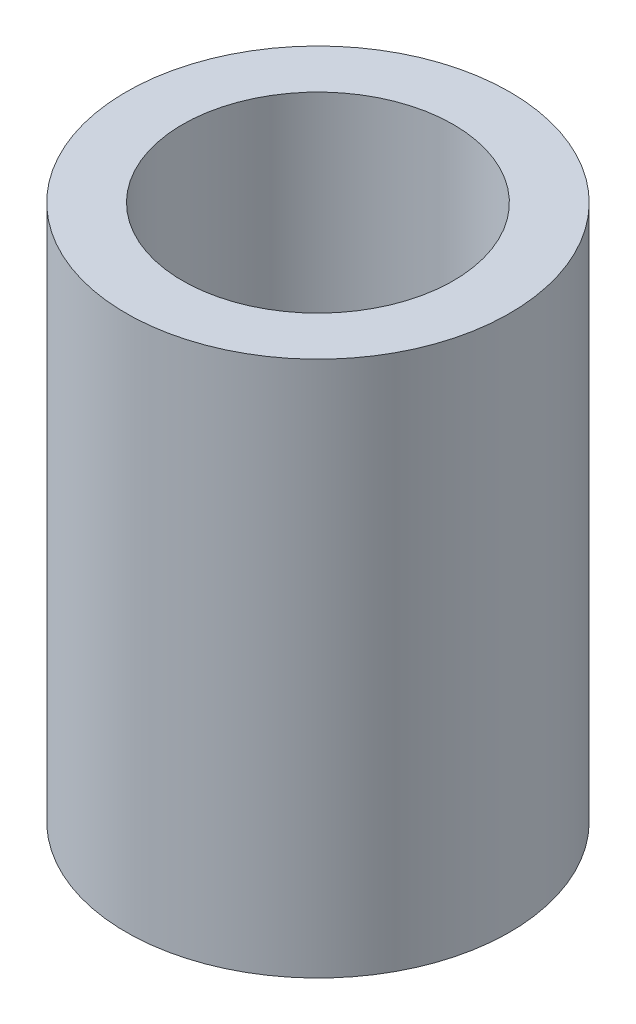
ISO-10303-21;
HEADER;
FILE_DESCRIPTION(('STEP AP214'),'2;1');
FILE_NAME('part.step','',(''),(''),'','','');
FILE_SCHEMA(('AUTOMOTIVE_DESIGN { 1 0 10303 214 1 1 1 1 }'));
ENDSEC;
DATA;
#1=APPLICATION_CONTEXT('core data for automotive mechanical design processes');
#2=APPLICATION_PROTOCOL_DEFINITION('international standard','automotive_design',2000,#1);
#3=PRODUCT_CONTEXT('',#1,'mechanical');
#4=PRODUCT('Part','Part','',(#3));
#5=PRODUCT_RELATED_PRODUCT_CATEGORY('part','',(#4));
#6=PRODUCT_DEFINITION_FORMATION('','',#4);
#7=PRODUCT_DEFINITION_CONTEXT('part definition',#1,'design');
#8=PRODUCT_DEFINITION('design','',#6,#7);
#9=PRODUCT_DEFINITION_SHAPE('','',#8);
#10=(LENGTH_UNIT() NAMED_UNIT(*) SI_UNIT(.MILLI.,.METRE.));
#11=(NAMED_UNIT(*) PLANE_ANGLE_UNIT() SI_UNIT($,.RADIAN.));
#12=(NAMED_UNIT(*) SI_UNIT($,.STERADIAN.) SOLID_ANGLE_UNIT());
#13=UNCERTAINTY_MEASURE_WITH_UNIT(LENGTH_MEASURE(1.E-05),#10,'distance_accuracy_value','');
#14=(GEOMETRIC_REPRESENTATION_CONTEXT(3) GLOBAL_UNCERTAINTY_ASSIGNED_CONTEXT((#13)) GLOBAL_UNIT_ASSIGNED_CONTEXT((#10,
#11,#12)) REPRESENTATION_CONTEXT('',''));
#15=CARTESIAN_POINT('',(0.,0.,0.));
#16=DIRECTION('',(0.,0.,1.));
#17=DIRECTION('',(1.,0.,0.));
#18=AXIS2_PLACEMENT_3D('',#15,#16,#17);
#19=CARTESIAN_POINT('',(0.,0.,0.));
#20=DIRECTION('',(0.,-1.,0.));
#21=DIRECTION('',(0.,0.,-1.));
#22=AXIS2_PLACEMENT_3D('',#19,#20,#21);
#23=CYLINDRICAL_SURFACE('',#22,24.);
#24=CARTESIAN_POINT('',(0.,0.,0.));
#25=DIRECTION('',(0.,-1.,0.));
#26=DIRECTION('',(0.,0.,-1.));
#27=AXIS2_PLACEMENT_3D('',#24,#25,#26);
#28=CIRCLE('',#27,24.);
#29=CARTESIAN_POINT('',(0.,0.,-24.));
#30=VERTEX_POINT('',#29);
#31=EDGE_CURVE('E51',#30,#30,#28,.T.);
#32=ORIENTED_EDGE('',*,*,#31,.T.);
#33=EDGE_LOOP('',(#32));
#34=FACE_BOUND('',#33,.T.);
#35=CARTESIAN_POINT('',(0.,95.,0.));
#36=DIRECTION('',(0.,-1.,0.));
#37=DIRECTION('',(0.,0.,-1.));
#38=AXIS2_PLACEMENT_3D('',#35,#36,#37);
#39=CIRCLE('',#38,24.);
#40=CARTESIAN_POINT('',(0.,95.,-24.));
#41=VERTEX_POINT('',#40);
#42=EDGE_CURVE('E10',#41,#41,#39,.T.);
#43=ORIENTED_EDGE('',*,*,#42,.F.);
#44=EDGE_LOOP('',(#43));
#45=FACE_BOUND('',#44,.T.);
#46=ADVANCED_FACE('F37',(#34,#45),#23,.F.);
#47=CARTESIAN_POINT('',(24.,95.,0.));
#48=DIRECTION('',(0.,1.,0.));
#49=DIRECTION('',(0.,0.,1.));
#50=AXIS2_PLACEMENT_3D('',#47,#48,#49);
#51=PLANE('',#50);
#52=ORIENTED_EDGE('',*,*,#42,.T.);
#53=EDGE_LOOP('',(#52));
#54=FACE_BOUND('',#53,.T.);
#55=CARTESIAN_POINT('',(0.,95.,0.));
#56=DIRECTION('',(0.,-1.,0.));
#57=DIRECTION('',(0.,0.,-1.));
#58=AXIS2_PLACEMENT_3D('',#55,#56,#57);
#59=CIRCLE('',#58,34.);
#60=CARTESIAN_POINT('',(0.,95.,-34.));
#61=VERTEX_POINT('',#60);
#62=EDGE_CURVE('E43',#61,#61,#59,.T.);
#63=ORIENTED_EDGE('',*,*,#62,.F.);
#64=EDGE_LOOP('',(#63));
#65=FACE_BOUND('',#64,.T.);
#66=ADVANCED_FACE('F67',(#54,#65),#51,.T.);
#67=CARTESIAN_POINT('',(0.,0.,0.));
#68=DIRECTION('',(0.,-1.,0.));
#69=DIRECTION('',(0.,0.,-1.));
#70=AXIS2_PLACEMENT_3D('',#67,#68,#69);
#71=CYLINDRICAL_SURFACE('',#70,34.);
#72=ORIENTED_EDGE('',*,*,#62,.T.);
#73=EDGE_LOOP('',(#72));
#74=FACE_BOUND('',#73,.T.);
#75=CARTESIAN_POINT('',(0.,0.,0.));
#76=DIRECTION('',(0.,-1.,0.));
#77=DIRECTION('',(0.,0.,-1.));
#78=AXIS2_PLACEMENT_3D('',#75,#76,#77);
#79=CIRCLE('',#78,34.);
#80=CARTESIAN_POINT('',(0.,0.,-34.));
#81=VERTEX_POINT('',#80);
#82=EDGE_CURVE('E47',#81,#81,#79,.T.);
#83=ORIENTED_EDGE('',*,*,#82,.F.);
#84=EDGE_LOOP('',(#83));
#85=FACE_BOUND('',#84,.T.);
#86=ADVANCED_FACE('F61',(#74,#85),#71,.T.);
#87=CARTESIAN_POINT('',(24.,0.,0.));
#88=DIRECTION('',(0.,-1.,0.));
#89=DIRECTION('',(0.,0.,-1.));
#90=AXIS2_PLACEMENT_3D('',#87,#88,#89);
#91=PLANE('',#90);
#92=ORIENTED_EDGE('',*,*,#82,.T.);
#93=EDGE_LOOP('',(#92));
#94=FACE_BOUND('',#93,.T.);
#95=ORIENTED_EDGE('',*,*,#31,.F.);
#96=EDGE_LOOP('',(#95));
#97=FACE_BOUND('',#96,.T.);
#98=ADVANCED_FACE('F59',(#94,#97),#91,.T.);
#99=CLOSED_SHELL('',(#46,#66,#86,#98));
#100=MANIFOLD_SOLID_BREP('B2',#99);
#101=ADVANCED_BREP_SHAPE_REPRESENTATION('',(#18,#100),#14);
#102=SHAPE_DEFINITION_REPRESENTATION(#9,#101);
ENDSEC;
END-ISO-10303-21;
